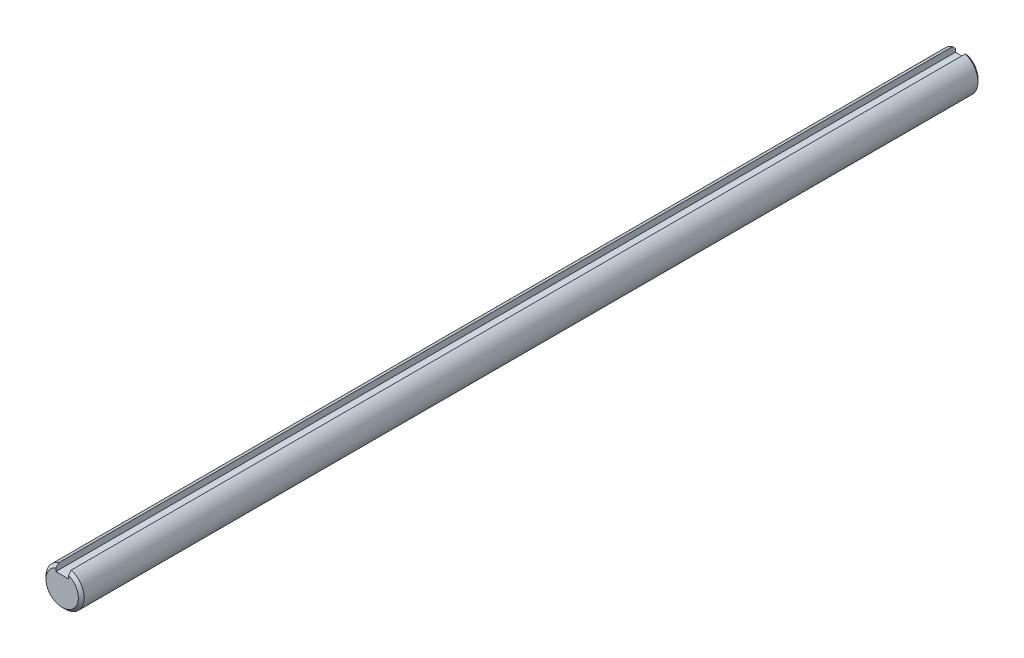
ISO-10303-21;
HEADER;
FILE_DESCRIPTION(('STEP AP214'),'2;1');
FILE_NAME('part.step','',(''),(''),'','','');
FILE_SCHEMA(('AUTOMOTIVE_DESIGN { 1 0 10303 214 1 1 1 1 }'));
ENDSEC;
DATA;
#1=APPLICATION_CONTEXT('core data for automotive mechanical design processes');
#2=APPLICATION_PROTOCOL_DEFINITION('international standard','automotive_design',2000,#1);
#3=PRODUCT_CONTEXT('',#1,'mechanical');
#4=PRODUCT('Part','Part','',(#3));
#5=PRODUCT_RELATED_PRODUCT_CATEGORY('part','',(#4));
#6=PRODUCT_DEFINITION_FORMATION('','',#4);
#7=PRODUCT_DEFINITION_CONTEXT('part definition',#1,'design');
#8=PRODUCT_DEFINITION('design','',#6,#7);
#9=PRODUCT_DEFINITION_SHAPE('','',#8);
#10=(LENGTH_UNIT() NAMED_UNIT(*) SI_UNIT(.MILLI.,.METRE.));
#11=(NAMED_UNIT(*) PLANE_ANGLE_UNIT() SI_UNIT($,.RADIAN.));
#12=(NAMED_UNIT(*) SI_UNIT($,.STERADIAN.) SOLID_ANGLE_UNIT());
#13=UNCERTAINTY_MEASURE_WITH_UNIT(LENGTH_MEASURE(1.E-05),#10,'distance_accuracy_value','');
#14=(GEOMETRIC_REPRESENTATION_CONTEXT(3) GLOBAL_UNCERTAINTY_ASSIGNED_CONTEXT((#13)) GLOBAL_UNIT_ASSIGNED_CONTEXT((#10,
#11,#12)) REPRESENTATION_CONTEXT('',''));
#15=CARTESIAN_POINT('',(0.,0.,0.));
#16=DIRECTION('',(0.,0.,1.));
#17=DIRECTION('',(1.,0.,0.));
#18=AXIS2_PLACEMENT_3D('',#15,#16,#17);
#19=CARTESIAN_POINT('',(0.,0.,212.5));
#20=DIRECTION('',(0.,0.,-1.));
#21=DIRECTION('',(-1.,0.,0.));
#22=AXIS2_PLACEMENT_3D('',#19,#20,#21);
#23=CYLINDRICAL_SURFACE('',#22,9.);
#24=CARTESIAN_POINT('',(0.,0.,211.15));
#25=DIRECTION('',(0.,0.,1.));
#26=DIRECTION('',(1.,0.,0.));
#27=AXIS2_PLACEMENT_3D('',#24,#25,#26);
#28=CIRCLE('',#27,9.);
#29=CARTESIAN_POINT('',(3.,8.48528137423857,211.15));
#30=VERTEX_POINT('',#29);
#31=CARTESIAN_POINT('',(-3.,8.48528137423857,211.15));
#32=VERTEX_POINT('',#31);
#33=EDGE_CURVE('E174',#30,#32,#28,.F.);
#34=ORIENTED_EDGE('',*,*,#33,.T.);
#35=DIRECTION('',(0.,0.,-1.));
#36=VECTOR('',#35,1.);
#37=CARTESIAN_POINT('',(-3.,8.48528137423857,212.5));
#38=LINE('',#37,#36);
#39=CARTESIAN_POINT('',(-3.,8.48528137423857,-211.15));
#40=VERTEX_POINT('',#39);
#41=EDGE_CURVE('E147',#32,#40,#38,.T.);
#42=ORIENTED_EDGE('',*,*,#41,.T.);
#43=CARTESIAN_POINT('',(0.,0.,-211.15));
#44=DIRECTION('',(0.,0.,1.));
#45=DIRECTION('',(1.,0.,0.));
#46=AXIS2_PLACEMENT_3D('',#43,#44,#45);
#47=CIRCLE('',#46,9.);
#48=CARTESIAN_POINT('',(3.,8.48528137423857,-211.15));
#49=VERTEX_POINT('',#48);
#50=EDGE_CURVE('E170',#40,#49,#47,.T.);
#51=ORIENTED_EDGE('',*,*,#50,.T.);
#52=DIRECTION('',(0.,0.,-1.));
#53=VECTOR('',#52,1.);
#54=CARTESIAN_POINT('',(3.,8.48528137423857,212.5));
#55=LINE('',#54,#53);
#56=EDGE_CURVE('E134',#49,#30,#55,.F.);
#57=ORIENTED_EDGE('',*,*,#56,.T.);
#58=EDGE_LOOP('',(#34,#42,#51,#57));
#59=FACE_BOUND('',#58,.T.);
#60=ADVANCED_FACE('F39',(#59),#23,.T.);
#61=CARTESIAN_POINT('',(0.,0.,212.5));
#62=DIRECTION('',(0.,0.,1.));
#63=DIRECTION('',(1.,0.,0.));
#64=AXIS2_PLACEMENT_3D('',#61,#62,#63);
#65=PLANE('',#64);
#66=DIRECTION('',(0.,-1.,0.));
#67=VECTOR('',#66,1.);
#68=CARTESIAN_POINT('',(-3.,9.,212.5));
#69=LINE('',#68,#67);
#70=CARTESIAN_POINT('',(-3.,7.03722246344399,212.5));
#71=VERTEX_POINT('',#70);
#72=CARTESIAN_POINT('',(-3.,5.5,212.5));
#73=VERTEX_POINT('',#72);
#74=EDGE_CURVE('E96',#71,#73,#69,.T.);
#75=ORIENTED_EDGE('',*,*,#74,.F.);
#76=CARTESIAN_POINT('',(0.,0.,212.5));
#77=DIRECTION('',(0.,0.,1.));
#78=DIRECTION('',(1.,0.,0.));
#79=AXIS2_PLACEMENT_3D('',#76,#77,#78);
#80=CIRCLE('',#79,7.65000000000005);
#81=CARTESIAN_POINT('',(3.,7.03722246344399,212.5));
#82=VERTEX_POINT('',#81);
#83=EDGE_CURVE('E163',#71,#82,#80,.T.);
#84=ORIENTED_EDGE('',*,*,#83,.T.);
#85=DIRECTION('',(0.,1.,0.));
#86=VECTOR('',#85,1.);
#87=CARTESIAN_POINT('',(3.,9.,212.5));
#88=LINE('',#87,#86);
#89=CARTESIAN_POINT('',(3.,5.5,212.5));
#90=VERTEX_POINT('',#89);
#91=EDGE_CURVE('E61',#90,#82,#88,.T.);
#92=ORIENTED_EDGE('',*,*,#91,.F.);
#93=DIRECTION('',(1.,0.,0.));
#94=VECTOR('',#93,1.);
#95=CARTESIAN_POINT('',(-3.,5.5,212.5));
#96=LINE('',#95,#94);
#97=EDGE_CURVE('E107',#73,#90,#96,.T.);
#98=ORIENTED_EDGE('',*,*,#97,.F.);
#99=EDGE_LOOP('',(#75,#84,#92,#98));
#100=FACE_BOUND('',#99,.T.);
#101=ADVANCED_FACE('F119',(#100),#65,.T.);
#102=CARTESIAN_POINT('',(0.,0.,-212.5));
#103=DIRECTION('',(0.,0.,1.));
#104=DIRECTION('',(1.,0.,0.));
#105=AXIS2_PLACEMENT_3D('',#102,#103,#104);
#106=PLANE('',#105);
#107=CARTESIAN_POINT('',(0.,0.,-212.5));
#108=DIRECTION('',(0.,0.,1.));
#109=DIRECTION('',(1.,0.,0.));
#110=AXIS2_PLACEMENT_3D('',#107,#108,#109);
#111=CIRCLE('',#110,7.64999999999999);
#112=CARTESIAN_POINT('',(3.,7.03722246344393,-212.5));
#113=VERTEX_POINT('',#112);
#114=CARTESIAN_POINT('',(-3.,7.03722246344393,-212.5));
#115=VERTEX_POINT('',#114);
#116=EDGE_CURVE('E166',#113,#115,#111,.F.);
#117=ORIENTED_EDGE('',*,*,#116,.T.);
#118=DIRECTION('',(0.,-1.,0.));
#119=VECTOR('',#118,1.);
#120=CARTESIAN_POINT('',(-3.,9.,-212.5));
#121=LINE('',#120,#119);
#122=CARTESIAN_POINT('',(-3.,5.5,-212.5));
#123=VERTEX_POINT('',#122);
#124=EDGE_CURVE('E123',#115,#123,#121,.T.);
#125=ORIENTED_EDGE('',*,*,#124,.T.);
#126=DIRECTION('',(1.,0.,0.));
#127=VECTOR('',#126,1.);
#128=CARTESIAN_POINT('',(-3.,5.5,-212.5));
#129=LINE('',#128,#127);
#130=CARTESIAN_POINT('',(3.,5.5,-212.5));
#131=VERTEX_POINT('',#130);
#132=EDGE_CURVE('E113',#123,#131,#129,.T.);
#133=ORIENTED_EDGE('',*,*,#132,.T.);
#134=DIRECTION('',(0.,1.,0.));
#135=VECTOR('',#134,1.);
#136=CARTESIAN_POINT('',(3.,9.,-212.5));
#137=LINE('',#136,#135);
#138=EDGE_CURVE('E117',#131,#113,#137,.T.);
#139=ORIENTED_EDGE('',*,*,#138,.T.);
#140=EDGE_LOOP('',(#117,#125,#133,#139));
#141=FACE_BOUND('',#140,.T.);
#142=ADVANCED_FACE('F188',(#141),#106,.F.);
#143=CARTESIAN_POINT('',(0.,0.,-211.15));
#144=DIRECTION('',(0.,0.,1.));
#145=DIRECTION('',(1.,0.,0.));
#146=AXIS2_PLACEMENT_3D('',#143,#144,#145);
#147=CONICAL_SURFACE('',#146,9.,0.785398163397445);
#148=CARTESIAN_POINT('',(-3.,1.28705422175556,-216.885569181352));
#149=CARTESIAN_POINT('',(-3.,1.39416593494417,-216.843289428009));
#150=CARTESIAN_POINT('',(-3.,1.49970504612452,-216.797273501872));
#151=CARTESIAN_POINT('',(-3.,1.7077948397404,-216.699193906731));
#152=CARTESIAN_POINT('',(-3.,1.81034895326585,-216.647137554417));
#153=CARTESIAN_POINT('',(-3.,2.01250497376197,-216.538495863693));
#154=CARTESIAN_POINT('',(-3.,2.11211642904187,-216.481928060458));
#155=CARTESIAN_POINT('',(-3.,2.30915207895785,-216.365044688312));
#156=CARTESIAN_POINT('',(-3.,2.40657551522032,-216.304727846454));
#157=CARTESIAN_POINT('',(-3.,2.59888060566882,-216.181528445959));
#158=CARTESIAN_POINT('',(-3.,2.69377470407578,-216.11866521502));
#159=CARTESIAN_POINT('',(-3.,2.88195057215755,-215.990564835985));
#160=CARTESIAN_POINT('',(-3.,2.97523222557868,-215.925327517766));
#161=CARTESIAN_POINT('',(-3.,3.25321336712602,-215.726595254567));
#162=CARTESIAN_POINT('',(-3.,3.43584713067476,-215.590212049234));
#163=CARTESIAN_POINT('',(-3.,3.77483382970666,-215.329292357859));
#164=CARTESIAN_POINT('',(-3.,3.93165748800281,-215.205360614922));
#165=CARTESIAN_POINT('',(-3.,4.24287389988178,-214.954473537919));
#166=CARTESIAN_POINT('',(-3.,4.39726656021101,-214.827518088331));
#167=CARTESIAN_POINT('',(-3.,4.70407768227175,-214.571359631066));
#168=CARTESIAN_POINT('',(-3.,4.85649681879052,-214.442157429007));
#169=CARTESIAN_POINT('',(-3.,5.15980015980952,-214.181961226792));
#170=CARTESIAN_POINT('',(-3.,5.31068433581822,-214.050967193482));
#171=CARTESIAN_POINT('',(-3.,5.76315575248964,-213.654413277248));
#172=CARTESIAN_POINT('',(-3.,6.06286560171808,-213.386712834444));
#173=CARTESIAN_POINT('',(-3.,6.65892063625382,-212.847589704052));
#174=CARTESIAN_POINT('',(-3.,6.95526570481031,-212.576166888023));
#175=CARTESIAN_POINT('',(-3.,7.48087483441551,-212.090486562521));
#176=CARTESIAN_POINT('',(-3.,7.71060801951142,-211.87673603365));
#177=CARTESIAN_POINT('',(-3.,8.16891776669348,-211.448007291003));
#178=CARTESIAN_POINT('',(-3.,8.39749434809234,-211.233029097855));
#179=CARTESIAN_POINT('',(-3.,9.08186503993765,-210.586650713135));
#180=CARTESIAN_POINT('',(-3.,9.5362973741506,-210.153809245877));
#181=CARTESIAN_POINT('',(-3.,10.4379308864423,-209.290261394176));
#182=CARTESIAN_POINT('',(-3.,10.8851574882398,-208.859581495681));
#183=CARTESIAN_POINT('',(-3.,11.5547479712263,-208.212288122079));
#184=CARTESIAN_POINT('',(-3.,11.7777321033367,-207.996315753523));
#185=CARTESIAN_POINT('',(-3.,12.2233453796936,-207.564005179311));
#186=CARTESIAN_POINT('',(-3.,12.4459745240256,-207.347666973743));
#187=CARTESIAN_POINT('',(-3.,12.6684554624874,-207.131176558343));
#188=B_SPLINE_CURVE_WITH_KNOTS('',3,(#148,#149,#150,#151,#152,#153,#154,#155,#156,#157,#158,
#159,#160,#161,#162,#163,#164,#165,#166,#167,#168,#169,#170,#171,#172,#173,#174,#175,#176,#177,
#178,#179,#180,#181,#182,#183,#184,#185,#186,#187),.UNSPECIFIED.,.F.,.F.,(4,2,2,2,2,2,2,2,2,2,2,
2,2,2,2,2,2,2,2,4),(0.,0.345260517163672,0.69010710647636,1.03367318356842,1.37735655910378,
1.71879551786011,2.06025899178175,2.74390904952985,3.34351590462938,3.94314570501071,
4.54256475736874,5.14199491575399,6.34751226495427,7.55307131602837,8.49444752726595,
9.4358079673907,11.3185399991295,13.1811862611621,14.1124720431243,15.0437576004991),.UNSPECIFIED.);
#189=EDGE_CURVE('E69',#115,#40,#188,.T.);
#190=ORIENTED_EDGE('',*,*,#189,.F.);
#191=ORIENTED_EDGE('',*,*,#116,.F.);
#192=CARTESIAN_POINT('',(3.,12.6684554624874,-207.131176558343));
#193=CARTESIAN_POINT('',(3.,12.4443629858941,-207.349235092537));
#194=CARTESIAN_POINT('',(3.,12.2201201695381,-207.567139220884));
#195=CARTESIAN_POINT('',(3.,11.7712744081235,-208.002575423281));
#196=CARTESIAN_POINT('',(3.,11.5466714637079,-208.220107497994));
#197=CARTESIAN_POINT('',(3.,10.8725460583514,-208.871748423888));
#198=CARTESIAN_POINT('',(3.,10.4223942062384,-209.30520671031));
#199=CARTESIAN_POINT('',(3.,9.52101749576605,-210.168375666524));
#200=CARTESIAN_POINT('',(3.,9.06979958531306,-210.598093575792));
#201=CARTESIAN_POINT('',(3.,8.39012596237551,-211.239964360573));
#202=CARTESIAN_POINT('',(3.,8.16301630644125,-211.453542078714));
#203=CARTESIAN_POINT('',(3.,7.70764902442767,-211.879489481341));
#204=CARTESIAN_POINT('',(3.,7.47939135327407,-212.091859117685));
#205=CARTESIAN_POINT('',(3.,7.02013555419468,-212.516223209438));
#206=CARTESIAN_POINT('',(3.,6.78912923162493,-212.728208805844));
#207=CARTESIAN_POINT('',(3.,6.32523552508441,-213.150051945176));
#208=CARTESIAN_POINT('',(3.,6.09234840304179,-213.359909775546));
#209=CARTESIAN_POINT('',(3.,5.62444332287706,-213.776382223241));
#210=CARTESIAN_POINT('',(3.,5.38942998766918,-213.983002025888));
#211=CARTESIAN_POINT('',(3.,4.91579369350943,-214.392332988542));
#212=CARTESIAN_POINT('',(3.,4.67716896563096,-214.595042114663));
#213=CARTESIAN_POINT('',(3.,4.31477214811537,-214.895221803312));
#214=CARTESIAN_POINT('',(3.,4.19285453818271,-214.994929842784));
#215=CARTESIAN_POINT('',(3.,3.9474931577838,-215.192441388574));
#216=CARTESIAN_POINT('',(3.,3.82404946978758,-215.290244997078));
#217=CARTESIAN_POINT('',(3.,3.57547725617892,-215.483318326067));
#218=CARTESIAN_POINT('',(3.,3.45035142568924,-215.578591506867));
#219=CARTESIAN_POINT('',(3.,3.19778471242306,-215.766090849071));
#220=CARTESIAN_POINT('',(3.,3.07034333229038,-215.858316343581));
#221=CARTESIAN_POINT('',(3.,2.81174416951203,-216.039365351446));
#222=CARTESIAN_POINT('',(3.,2.6805668352617,-216.128161057736));
#223=CARTESIAN_POINT('',(3.,2.41472121060693,-216.300246962678));
#224=CARTESIAN_POINT('',(3.,2.28005514925244,-216.383540561625));
#225=CARTESIAN_POINT('',(3.,2.07443625756613,-216.503059940307));
#226=CARTESIAN_POINT('',(3.,2.00511170562083,-216.542088862621));
#227=CARTESIAN_POINT('',(3.,1.86525443696881,-216.617901748158));
#228=CARTESIAN_POINT('',(3.,1.79472190356857,-216.654686048196));
#229=CARTESIAN_POINT('',(3.,1.65218360515425,-216.725692751653));
#230=CARTESIAN_POINT('',(3.,1.58017503992554,-216.759909572492));
#231=CARTESIAN_POINT('',(3.,1.43471110691237,-216.825216006186));
#232=CARTESIAN_POINT('',(3.,1.36125498684721,-216.856303938843));
#233=CARTESIAN_POINT('',(3.,1.28705422175556,-216.885569181352));
#234=B_SPLINE_CURVE_WITH_KNOTS('',3,(#192,#193,#194,#195,#196,#197,#198,#199,#200,#201,#202,
#203,#204,#205,#206,#207,#208,#209,#210,#211,#212,#213,#214,#215,#216,#217,#218,#219,#220,#221,
#222,#223,#224,#225,#226,#227,#228,#229,#230,#231,#232,#233),.UNSPECIFIED.,.F.,.F.,(4,2,2,2,2,2,
2,2,2,2,2,2,2,2,2,2,2,2,2,2,4),(0.,0.938031249020108,1.87606082527995,3.75080984684275,
5.62009648450806,6.55537289706373,7.49068632238739,8.43127072482425,9.37172632187258,
10.3104787015688,11.2497068219196,11.7221862809691,12.1946403176433,12.6664110152082,
13.1382842710489,13.613407650853,14.0882346035915,14.3268694808719,14.5654684615732,
14.8045720461496,15.0438033507551),.UNSPECIFIED.);
#235=EDGE_CURVE('E139',#49,#113,#234,.T.);
#236=ORIENTED_EDGE('',*,*,#235,.F.);
#237=ORIENTED_EDGE('',*,*,#50,.F.);
#238=EDGE_LOOP('',(#190,#191,#236,#237));
#239=FACE_BOUND('',#238,.T.);
#240=ADVANCED_FACE('F149',(#239),#147,.T.);
#241=CARTESIAN_POINT('',(0.,0.,212.5));
#242=DIRECTION('',(0.,0.,-1.));
#243=DIRECTION('',(-1.,0.,0.));
#244=AXIS2_PLACEMENT_3D('',#241,#242,#243);
#245=CONICAL_SURFACE('',#244,7.65000000000005,0.785398163397435);
#246=CARTESIAN_POINT('',(-3.,12.6684554624874,207.131176558343));
#247=CARTESIAN_POINT('',(-3.,12.4443629858941,207.349235092537));
#248=CARTESIAN_POINT('',(-3.,12.220120169538,207.567139220884));
#249=CARTESIAN_POINT('',(-3.,11.7712744081235,208.002575423281));
#250=CARTESIAN_POINT('',(-3.,11.5466714637079,208.220107497994));
#251=CARTESIAN_POINT('',(-3.,10.8725460583513,208.871748423888));
#252=CARTESIAN_POINT('',(-3.,10.4223942062383,209.30520671031));
#253=CARTESIAN_POINT('',(-3.,9.52101749576604,210.168375666524));
#254=CARTESIAN_POINT('',(-3.,9.06979958531304,210.598093575792));
#255=CARTESIAN_POINT('',(-3.,8.3901259623755,211.239964360573));
#256=CARTESIAN_POINT('',(-3.,8.16301630644125,211.453542078714));
#257=CARTESIAN_POINT('',(-3.,7.70764902442767,211.879489481341));
#258=CARTESIAN_POINT('',(-3.,7.47939135327409,212.091859117685));
#259=CARTESIAN_POINT('',(-3.,7.0201355541947,212.516223209438));
#260=CARTESIAN_POINT('',(-3.,6.78912923162495,212.728208805844));
#261=CARTESIAN_POINT('',(-3.,6.32523552508445,213.150051945176));
#262=CARTESIAN_POINT('',(-3.,6.09234840304184,213.359909775546));
#263=CARTESIAN_POINT('',(-3.,5.62444332287712,213.776382223241));
#264=CARTESIAN_POINT('',(-3.,5.38942998766924,213.983002025888));
#265=CARTESIAN_POINT('',(-3.,4.91579369350951,214.392332988542));
#266=CARTESIAN_POINT('',(-3.,4.67716896563106,214.595042114663));
#267=CARTESIAN_POINT('',(-3.,4.31477214811545,214.895221803312));
#268=CARTESIAN_POINT('',(-3.,4.19285453818278,214.994929842784));
#269=CARTESIAN_POINT('',(-3.,3.94749315778387,215.192441388574));
#270=CARTESIAN_POINT('',(-3.,3.82404946978766,215.290244997078));
#271=CARTESIAN_POINT('',(-3.,3.575477256179,215.483318326067));
#272=CARTESIAN_POINT('',(-3.,3.45035142568932,215.578591506867));
#273=CARTESIAN_POINT('',(-3.,3.19778471242314,215.766090849071));
#274=CARTESIAN_POINT('',(-3.,3.07034333229048,215.858316343581));
#275=CARTESIAN_POINT('',(-3.,2.81174416951213,216.039365351446));
#276=CARTESIAN_POINT('',(-3.,2.68056683526181,216.128161057736));
#277=CARTESIAN_POINT('',(-3.,2.41472121060705,216.300246962678));
#278=CARTESIAN_POINT('',(-3.,2.28005514925255,216.383540561625));
#279=CARTESIAN_POINT('',(-3.,2.07443625756624,216.503059940307));
#280=CARTESIAN_POINT('',(-3.,2.00511170562093,216.542088862621));
#281=CARTESIAN_POINT('',(-3.,1.86525443696892,216.617901748158));
#282=CARTESIAN_POINT('',(-3.,1.79472190356869,216.654686048196));
#283=CARTESIAN_POINT('',(-3.,1.65218360515438,216.725692751653));
#284=CARTESIAN_POINT('',(-3.,1.58017503992568,216.759909572492));
#285=CARTESIAN_POINT('',(-3.,1.43471110691251,216.825216006186));
#286=CARTESIAN_POINT('',(-3.,1.36125498684736,216.856303938843));
#287=CARTESIAN_POINT('',(-3.,1.28705422175571,216.885569181352));
#288=B_SPLINE_CURVE_WITH_KNOTS('',3,(#246,#247,#248,#249,#250,#251,#252,#253,#254,#255,#256,
#257,#258,#259,#260,#261,#262,#263,#264,#265,#266,#267,#268,#269,#270,#271,#272,#273,#274,#275,
#276,#277,#278,#279,#280,#281,#282,#283,#284,#285,#286,#287),.UNSPECIFIED.,.F.,.F.,(4,2,2,2,2,2,
2,2,2,2,2,2,2,2,2,2,2,2,2,2,4),(0.,0.93803124902009,1.87606082527993,3.75080984684274,
5.62009648450804,6.55537289706373,7.49068632238735,8.43127072482421,9.37172632187252,
10.3104787015687,11.2497068219195,11.7221862809691,12.1946403176433,12.6664110152081,
13.1382842710488,13.6134076508529,14.0882346035914,14.3268694808719,14.5654684615731,
14.8045720461495,15.043803350755),.UNSPECIFIED.);
#289=EDGE_CURVE('E11',#32,#71,#288,.T.);
#290=ORIENTED_EDGE('',*,*,#289,.F.);
#291=ORIENTED_EDGE('',*,*,#33,.F.);
#292=CARTESIAN_POINT('',(3.,1.28705422175571,216.885569181352));
#293=CARTESIAN_POINT('',(3.,1.39416593494433,216.843289428009));
#294=CARTESIAN_POINT('',(3.,1.49970504612469,216.797273501872));
#295=CARTESIAN_POINT('',(3.,1.70779483974059,216.699193906731));
#296=CARTESIAN_POINT('',(3.,1.81034895326604,216.647137554417));
#297=CARTESIAN_POINT('',(3.,2.01250497376218,216.538495863693));
#298=CARTESIAN_POINT('',(3.,2.11211642904208,216.481928060458));
#299=CARTESIAN_POINT('',(3.,2.30915207895807,216.365044688312));
#300=CARTESIAN_POINT('',(3.,2.40657551522055,216.304727846454));
#301=CARTESIAN_POINT('',(3.,2.59888060566906,216.181528445959));
#302=CARTESIAN_POINT('',(3.,2.69377470407603,216.11866521502));
#303=CARTESIAN_POINT('',(3.,2.88195057215781,215.990564835985));
#304=CARTESIAN_POINT('',(3.,2.97523222557895,215.925327517766));
#305=CARTESIAN_POINT('',(3.,3.2532133671263,215.726595254567));
#306=CARTESIAN_POINT('',(3.,3.43584713067506,215.590212049234));
#307=CARTESIAN_POINT('',(3.,3.77483382970696,215.329292357859));
#308=CARTESIAN_POINT('',(3.,3.9316574880031,215.205360614922));
#309=CARTESIAN_POINT('',(3.,4.24287389988204,214.954473537919));
#310=CARTESIAN_POINT('',(3.,4.39726656021125,214.827518088331));
#311=CARTESIAN_POINT('',(3.,4.70407768227198,214.571359631066));
#312=CARTESIAN_POINT('',(3.,4.85649681879075,214.442157429007));
#313=CARTESIAN_POINT('',(3.,5.15980015980973,214.181961226792));
#314=CARTESIAN_POINT('',(3.,5.31068433581842,214.050967193482));
#315=CARTESIAN_POINT('',(3.,5.7631557524898,213.654413277248));
#316=CARTESIAN_POINT('',(3.,6.06286560171821,213.386712834444));
#317=CARTESIAN_POINT('',(3.,6.65892063625391,212.847589704052));
#318=CARTESIAN_POINT('',(3.,6.95526570481038,212.576166888023));
#319=CARTESIAN_POINT('',(3.,7.48087483441555,212.090486562521));
#320=CARTESIAN_POINT('',(3.,7.71060801951146,211.87673603365));
#321=CARTESIAN_POINT('',(3.,8.1689177666935,211.448007291003));
#322=CARTESIAN_POINT('',(3.,8.39749434809236,211.233029097855));
#323=CARTESIAN_POINT('',(3.,9.08186503993765,210.586650713135));
#324=CARTESIAN_POINT('',(3.,9.5362973741506,210.153809245877));
#325=CARTESIAN_POINT('',(3.,10.4379308864423,209.290261394176));
#326=CARTESIAN_POINT('',(3.,10.8851574882398,208.859581495681));
#327=CARTESIAN_POINT('',(3.,11.5547479712262,208.212288122079));
#328=CARTESIAN_POINT('',(3.,11.7777321033367,207.996315753523));
#329=CARTESIAN_POINT('',(3.,12.2233453796935,207.564005179311));
#330=CARTESIAN_POINT('',(3.,12.4459745240255,207.347666973743));
#331=CARTESIAN_POINT('',(3.,12.6684554624874,207.131176558343));
#332=B_SPLINE_CURVE_WITH_KNOTS('',3,(#292,#293,#294,#295,#296,#297,#298,#299,#300,#301,#302,
#303,#304,#305,#306,#307,#308,#309,#310,#311,#312,#313,#314,#315,#316,#317,#318,#319,#320,#321,
#322,#323,#324,#325,#326,#327,#328,#329,#330,#331),.UNSPECIFIED.,.F.,.F.,(4,2,2,2,2,2,2,2,2,2,2,
2,2,2,2,2,2,2,2,4),(0.,0.345260517163712,0.690107106476433,1.03367318356852,1.37735655910391,
1.71879551786027,2.06025899178194,2.74390904953009,3.34351590462959,3.94314570501089,
4.54256475736889,5.14199491575412,6.34751226495432,7.55307131602831,8.49444752726587,
9.43580796739064,11.3185399991295,13.181186261162,14.1124720431242,15.043757600499),.UNSPECIFIED.);
#333=EDGE_CURVE('E54',#82,#30,#332,.T.);
#334=ORIENTED_EDGE('',*,*,#333,.F.);
#335=ORIENTED_EDGE('',*,*,#83,.F.);
#336=EDGE_LOOP('',(#290,#291,#334,#335));
#337=FACE_BOUND('',#336,.T.);
#338=ADVANCED_FACE('F41',(#337),#245,.T.);
#339=CARTESIAN_POINT('',(-3.,9.,-212.5));
#340=DIRECTION('',(-1.,0.,0.));
#341=DIRECTION('',(0.,-1.,0.));
#342=AXIS2_PLACEMENT_3D('',#339,#340,#341);
#343=PLANE('',#342);
#344=ORIENTED_EDGE('',*,*,#189,.T.);
#345=ORIENTED_EDGE('',*,*,#41,.F.);
#346=ORIENTED_EDGE('',*,*,#289,.T.);
#347=ORIENTED_EDGE('',*,*,#74,.T.);
#348=DIRECTION('',(0.,0.,1.));
#349=VECTOR('',#348,1.);
#350=CARTESIAN_POINT('',(-3.,5.5,-212.5));
#351=LINE('',#350,#349);
#352=EDGE_CURVE('E99',#123,#73,#351,.T.);
#353=ORIENTED_EDGE('',*,*,#352,.F.);
#354=ORIENTED_EDGE('',*,*,#124,.F.);
#355=EDGE_LOOP('',(#344,#345,#346,#347,#353,#354));
#356=FACE_BOUND('',#355,.T.);
#357=ADVANCED_FACE('F98',(#356),#343,.F.);
#358=CARTESIAN_POINT('',(3.,9.,-212.5));
#359=DIRECTION('',(1.,0.,0.));
#360=DIRECTION('',(0.,1.,0.));
#361=AXIS2_PLACEMENT_3D('',#358,#359,#360);
#362=PLANE('',#361);
#363=ORIENTED_EDGE('',*,*,#235,.T.);
#364=ORIENTED_EDGE('',*,*,#138,.F.);
#365=DIRECTION('',(0.,0.,1.));
#366=VECTOR('',#365,1.);
#367=CARTESIAN_POINT('',(3.,5.5,-212.5));
#368=LINE('',#367,#366);
#369=EDGE_CURVE('E116',#131,#90,#368,.T.);
#370=ORIENTED_EDGE('',*,*,#369,.T.);
#371=ORIENTED_EDGE('',*,*,#91,.T.);
#372=ORIENTED_EDGE('',*,*,#333,.T.);
#373=ORIENTED_EDGE('',*,*,#56,.F.);
#374=EDGE_LOOP('',(#363,#364,#370,#371,#372,#373));
#375=FACE_BOUND('',#374,.T.);
#376=ADVANCED_FACE('F152',(#375),#362,.F.);
#377=CARTESIAN_POINT('',(-3.,5.5,-212.5));
#378=DIRECTION('',(0.,-1.,0.));
#379=DIRECTION('',(0.,0.,-1.));
#380=AXIS2_PLACEMENT_3D('',#377,#378,#379);
#381=PLANE('',#380);
#382=ORIENTED_EDGE('',*,*,#369,.F.);
#383=ORIENTED_EDGE('',*,*,#132,.F.);
#384=ORIENTED_EDGE('',*,*,#352,.T.);
#385=ORIENTED_EDGE('',*,*,#97,.T.);
#386=EDGE_LOOP('',(#382,#383,#384,#385));
#387=FACE_BOUND('',#386,.T.);
#388=ADVANCED_FACE('F111',(#387),#381,.F.);
#389=CLOSED_SHELL('',(#60,#101,#142,#240,#338,#357,#376,#388));
#390=MANIFOLD_SOLID_BREP('B2',#389);
#391=ADVANCED_BREP_SHAPE_REPRESENTATION('',(#18,#390),#14);
#392=SHAPE_DEFINITION_REPRESENTATION(#9,#391);
ENDSEC;
END-ISO-10303-21;
